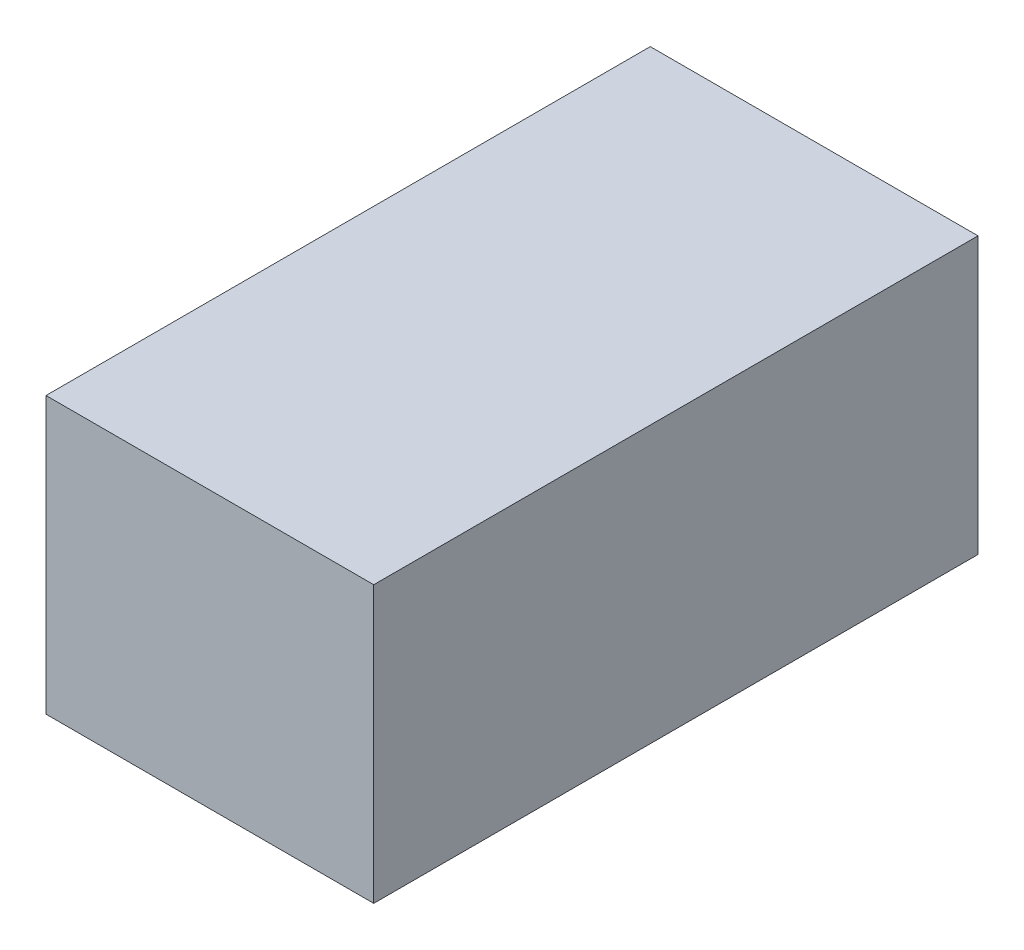
ISO-10303-21;
HEADER;
FILE_DESCRIPTION(('STEP AP214'),'2;1');
FILE_NAME('part.step','',(''),(''),'','','');
FILE_SCHEMA(('AUTOMOTIVE_DESIGN { 1 0 10303 214 1 1 1 1 }'));
ENDSEC;
DATA;
#1=APPLICATION_CONTEXT('core data for automotive mechanical design processes');
#2=APPLICATION_PROTOCOL_DEFINITION('international standard','automotive_design',2000,#1);
#3=PRODUCT_CONTEXT('',#1,'mechanical');
#4=PRODUCT('Part','Part','',(#3));
#5=PRODUCT_RELATED_PRODUCT_CATEGORY('part','',(#4));
#6=PRODUCT_DEFINITION_FORMATION('','',#4);
#7=PRODUCT_DEFINITION_CONTEXT('part definition',#1,'design');
#8=PRODUCT_DEFINITION('design','',#6,#7);
#9=PRODUCT_DEFINITION_SHAPE('','',#8);
#10=(LENGTH_UNIT() NAMED_UNIT(*) SI_UNIT(.MILLI.,.METRE.));
#11=(NAMED_UNIT(*) PLANE_ANGLE_UNIT() SI_UNIT($,.RADIAN.));
#12=(NAMED_UNIT(*) SI_UNIT($,.STERADIAN.) SOLID_ANGLE_UNIT());
#13=UNCERTAINTY_MEASURE_WITH_UNIT(LENGTH_MEASURE(1.E-05),#10,'distance_accuracy_value','');
#14=(GEOMETRIC_REPRESENTATION_CONTEXT(3) GLOBAL_UNCERTAINTY_ASSIGNED_CONTEXT((#13)) GLOBAL_UNIT_ASSIGNED_CONTEXT((#10,
#11,#12)) REPRESENTATION_CONTEXT('',''));
#15=CARTESIAN_POINT('',(0.,0.,0.));
#16=DIRECTION('',(0.,0.,1.));
#17=DIRECTION('',(1.,0.,0.));
#18=AXIS2_PLACEMENT_3D('',#15,#16,#17);
#19=CARTESIAN_POINT('',(-72.39499368142,-1.701384399524,-44.44597974038));
#20=DIRECTION('',(0.,1.,0.));
#21=DIRECTION('',(0.,0.,1.));
#22=AXIS2_PLACEMENT_3D('',#19,#20,#21);
#23=PLANE('',#22);
#24=DIRECTION('',(0.,0.,1.));
#25=VECTOR('',#24,1.);
#26=CARTESIAN_POINT('',(-69.54500443493,-1.701384340965,-47.7884795988));
#27=LINE('',#26,#25);
#28=CARTESIAN_POINT('',(-69.5450044363575,-1.70138435560475,-47.4236397376321));
#29=VERTEX_POINT('',#28);
#30=CARTESIAN_POINT('',(-69.54500443493,-1.70138438488425,-47.0733197376421));
#31=VERTEX_POINT('',#30);
#32=EDGE_CURVE('E19',#29,#31,#27,.T.);
#33=ORIENTED_EDGE('',*,*,#32,.T.);
#34=DIRECTION('',(1.,0.,0.));
#35=VECTOR('',#34,1.);
#36=CARTESIAN_POINT('',(-73.12019237886,-1.701384399524,-47.0733197376484));
#37=LINE('',#36,#35);
#38=CARTESIAN_POINT('',(-69.73500447206,-1.701384399524,-47.0733197376421));
#39=VERTEX_POINT('',#38);
#40=EDGE_CURVE('E79',#39,#31,#37,.T.);
#41=ORIENTED_EDGE('',*,*,#40,.F.);
#42=DIRECTION('',(0.,0.,-1.));
#43=VECTOR('',#42,1.);
#44=CARTESIAN_POINT('',(-69.73500447043,-1.701384399524,-47.24847974281));
#45=LINE('',#44,#43);
#46=CARTESIAN_POINT('',(-69.7350044698975,-1.7013843702445,-47.4236397377067));
#47=VERTEX_POINT('',#46);
#48=EDGE_CURVE('E67',#39,#47,#45,.T.);
#49=ORIENTED_EDGE('',*,*,#48,.T.);
#50=DIRECTION('',(1.,0.,0.));
#51=VECTOR('',#50,1.);
#52=CARTESIAN_POINT('',(-74.98500392881,-1.701384340965,-47.4236397376384));
#53=LINE('',#52,#51);
#54=EDGE_CURVE('E54',#29,#47,#53,.F.);
#55=ORIENTED_EDGE('',*,*,#54,.F.);
#56=EDGE_LOOP('',(#33,#41,#49,#55));
#57=FACE_BOUND('',#56,.T.);
#58=ADVANCED_FACE('F16',(#57),#23,.F.);
#59=CARTESIAN_POINT('',(-69.54500443493,-2.057013797608,-47.7884795988));
#60=DIRECTION('',(-1.,0.,0.));
#61=DIRECTION('',(0.,0.,1.));
#62=AXIS2_PLACEMENT_3D('',#59,#60,#61);
#63=PLANE('',#62);
#64=DIRECTION('',(0.,0.,1.));
#65=VECTOR('',#64,1.);
#66=CARTESIAN_POINT('',(-69.54500443493,-1.541385122797,-47.2486397349));
#67=LINE('',#66,#65);
#68=CARTESIAN_POINT('',(-69.54500443493,-1.541385122797,-47.0733197376422));
#69=VERTEX_POINT('',#68);
#70=CARTESIAN_POINT('',(-69.5450044363575,-1.54138511441975,-47.4236397376322));
#71=VERTEX_POINT('',#70);
#72=EDGE_CURVE('E82',#69,#71,#67,.F.);
#73=ORIENTED_EDGE('',*,*,#72,.F.);
#74=DIRECTION('',(0.,-1.,1.798143292204E-12));
#75=VECTOR('',#74,1.);
#76=CARTESIAN_POINT('',(-69.54500443493,-0.806384399451,-47.07331973765));
#77=LINE('',#76,#75);
#78=EDGE_CURVE('E63',#31,#69,#77,.F.);
#79=ORIENTED_EDGE('',*,*,#78,.F.);
#80=ORIENTED_EDGE('',*,*,#32,.F.);
#81=DIRECTION('',(0.,1.,-1.798143292204E-12));
#82=VECTOR('',#81,1.);
#83=CARTESIAN_POINT('',(-69.54500444064,-0.806384399449,-47.42363973764));
#84=LINE('',#83,#82);
#85=EDGE_CURVE('E60',#71,#29,#84,.F.);
#86=ORIENTED_EDGE('',*,*,#85,.F.);
#87=EDGE_LOOP('',(#73,#79,#80,#86));
#88=FACE_BOUND('',#87,.T.);
#89=ADVANCED_FACE('F59',(#88),#63,.F.);
#90=CARTESIAN_POINT('',(-74.98500392881,-0.806384399449,-47.42363973764));
#91=DIRECTION('',(0.,-1.798143292204E-12,-1.));
#92=DIRECTION('',(0.,1.,-1.798143292204E-12));
#93=AXIS2_PLACEMENT_3D('',#90,#91,#92);
#94=PLANE('',#93);
#95=ORIENTED_EDGE('',*,*,#54,.T.);
#96=DIRECTION('',(0.,1.,0.));
#97=VECTOR('',#96,1.);
#98=CARTESIAN_POINT('',(-69.73500447043,-1.691384921744,-47.42363973792));
#99=LINE('',#98,#97);
#100=CARTESIAN_POINT('',(-69.7350044709125,-1.54138509766525,-47.4236397377068));
#101=VERTEX_POINT('',#100);
#102=EDGE_CURVE('E69',#47,#101,#99,.T.);
#103=ORIENTED_EDGE('',*,*,#102,.T.);
#104=DIRECTION('',(1.,0.,0.));
#105=VECTOR('',#104,1.);
#106=CARTESIAN_POINT('',(-72.39500445779,-1.541385122797,-47.42363973763));
#107=LINE('',#106,#105);
#108=EDGE_CURVE('E73',#71,#101,#107,.F.);
#109=ORIENTED_EDGE('',*,*,#108,.F.);
#110=ORIENTED_EDGE('',*,*,#85,.T.);
#111=EDGE_LOOP('',(#95,#103,#109,#110));
#112=FACE_BOUND('',#111,.T.);
#113=ADVANCED_FACE('F71',(#112),#94,.T.);
#114=CARTESIAN_POINT('',(-69.73500447043,-1.691384921744,-47.24847974281));
#115=DIRECTION('',(1.,0.,0.));
#116=DIRECTION('',(0.,0.,-1.));
#117=AXIS2_PLACEMENT_3D('',#114,#115,#116);
#118=PLANE('',#117);
#119=DIRECTION('',(0.,-1.,1.798143292204E-12));
#120=VECTOR('',#119,1.);
#121=CARTESIAN_POINT('',(-69.73500447766,-0.806384399451,-47.07331973765));
#122=LINE('',#121,#120);
#123=CARTESIAN_POINT('',(-69.735004473075,-1.5413851060425,-47.0733197376422));
#124=VERTEX_POINT('',#123);
#125=EDGE_CURVE('E34',#124,#39,#122,.T.);
#126=ORIENTED_EDGE('',*,*,#125,.F.);
#127=DIRECTION('',(0.,0.,1.));
#128=VECTOR('',#127,1.);
#129=CARTESIAN_POINT('',(-69.73500447378,-1.541385122797,-47.2486397349));
#130=LINE('',#129,#128);
#131=EDGE_CURVE('E25',#101,#124,#130,.T.);
#132=ORIENTED_EDGE('',*,*,#131,.F.);
#133=ORIENTED_EDGE('',*,*,#102,.F.);
#134=ORIENTED_EDGE('',*,*,#48,.F.);
#135=EDGE_LOOP('',(#126,#132,#133,#134));
#136=FACE_BOUND('',#135,.T.);
#137=ADVANCED_FACE('F88',(#136),#118,.F.);
#138=CARTESIAN_POINT('',(-73.12019237886,-0.806384399451,-47.07331973765));
#139=DIRECTION('',(0.,1.798143292204E-12,1.));
#140=DIRECTION('',(0.,-1.,1.798143292204E-12));
#141=AXIS2_PLACEMENT_3D('',#138,#139,#140);
#142=PLANE('',#141);
#143=ORIENTED_EDGE('',*,*,#40,.T.);
#144=ORIENTED_EDGE('',*,*,#78,.T.);
#145=DIRECTION('',(1.,0.,0.));
#146=VECTOR('',#145,1.);
#147=CARTESIAN_POINT('',(-72.39500445779,-1.541385122797,-47.07331973764));
#148=LINE('',#147,#146);
#149=EDGE_CURVE('E11',#124,#69,#148,.T.);
#150=ORIENTED_EDGE('',*,*,#149,.F.);
#151=ORIENTED_EDGE('',*,*,#125,.T.);
#152=EDGE_LOOP('',(#143,#144,#150,#151));
#153=FACE_BOUND('',#152,.T.);
#154=ADVANCED_FACE('F90',(#153),#142,.T.);
#155=CARTESIAN_POINT('',(-72.39500445779,-1.541385122797,-47.2486397349));
#156=DIRECTION('',(0.,1.,0.));
#157=DIRECTION('',(0.,0.,1.));
#158=AXIS2_PLACEMENT_3D('',#155,#156,#157);
#159=PLANE('',#158);
#160=ORIENTED_EDGE('',*,*,#131,.T.);
#161=ORIENTED_EDGE('',*,*,#149,.T.);
#162=ORIENTED_EDGE('',*,*,#72,.T.);
#163=ORIENTED_EDGE('',*,*,#108,.T.);
#164=EDGE_LOOP('',(#160,#161,#162,#163));
#165=FACE_BOUND('',#164,.T.);
#166=ADVANCED_FACE('F87',(#165),#159,.T.);
#167=CLOSED_SHELL('',(#58,#89,#113,#137,#154,#166));
#168=MANIFOLD_SOLID_BREP('B1',#167);
#169=ADVANCED_BREP_SHAPE_REPRESENTATION('',(#18,#168),#14);
#170=SHAPE_DEFINITION_REPRESENTATION(#9,#169);
ENDSEC;
END-ISO-10303-21;
